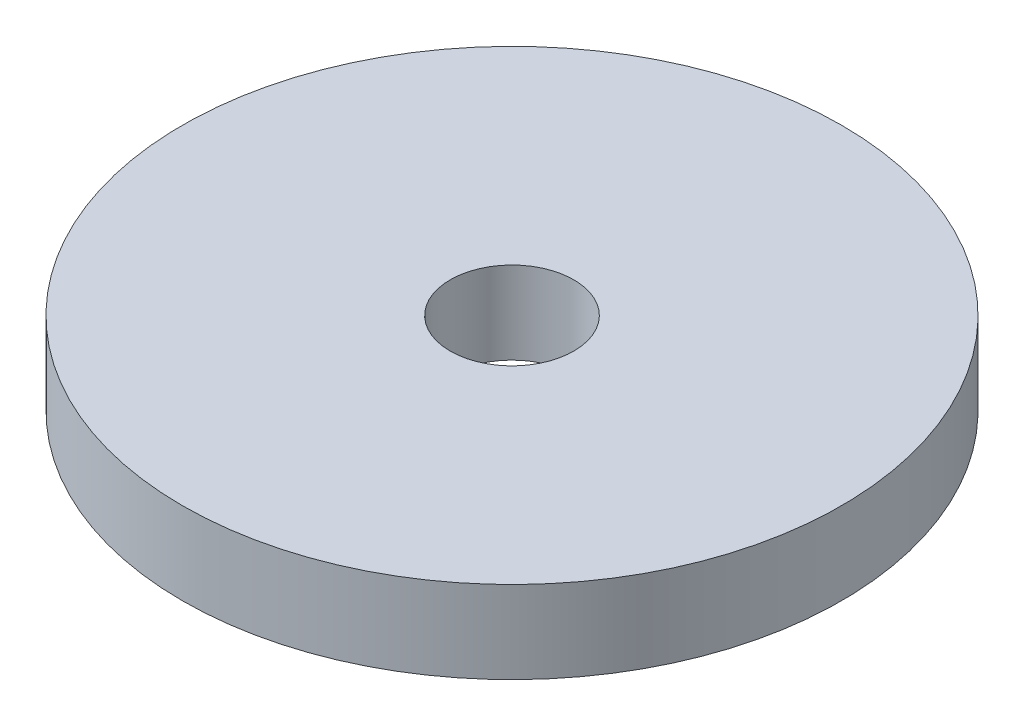
ISO-10303-21;
HEADER;
FILE_DESCRIPTION(('STEP AP214'),'2;1');
FILE_NAME('part.step','',(''),(''),'','','');
FILE_SCHEMA(('AUTOMOTIVE_DESIGN { 1 0 10303 214 1 1 1 1 }'));
ENDSEC;
DATA;
#1=APPLICATION_CONTEXT('core data for automotive mechanical design processes');
#2=APPLICATION_PROTOCOL_DEFINITION('international standard','automotive_design',2000,#1);
#3=PRODUCT_CONTEXT('',#1,'mechanical');
#4=PRODUCT('Part','Part','',(#3));
#5=PRODUCT_RELATED_PRODUCT_CATEGORY('part','',(#4));
#6=PRODUCT_DEFINITION_FORMATION('','',#4);
#7=PRODUCT_DEFINITION_CONTEXT('part definition',#1,'design');
#8=PRODUCT_DEFINITION('design','',#6,#7);
#9=PRODUCT_DEFINITION_SHAPE('','',#8);
#10=(LENGTH_UNIT() NAMED_UNIT(*) SI_UNIT(.MILLI.,.METRE.));
#11=(NAMED_UNIT(*) PLANE_ANGLE_UNIT() SI_UNIT($,.RADIAN.));
#12=(NAMED_UNIT(*) SI_UNIT($,.STERADIAN.) SOLID_ANGLE_UNIT());
#13=UNCERTAINTY_MEASURE_WITH_UNIT(LENGTH_MEASURE(1.E-05),#10,'distance_accuracy_value','');
#14=(GEOMETRIC_REPRESENTATION_CONTEXT(3) GLOBAL_UNCERTAINTY_ASSIGNED_CONTEXT((#13)) GLOBAL_UNIT_ASSIGNED_CONTEXT((#10,
#11,#12)) REPRESENTATION_CONTEXT('',''));
#15=CARTESIAN_POINT('',(0.,0.,0.));
#16=DIRECTION('',(0.,0.,1.));
#17=DIRECTION('',(1.,0.,0.));
#18=AXIS2_PLACEMENT_3D('',#15,#16,#17);
#19=CARTESIAN_POINT('',(0.,6.35,0.));
#20=DIRECTION('',(0.,1.,0.));
#21=DIRECTION('',(0.,0.,1.));
#22=AXIS2_PLACEMENT_3D('',#19,#20,#21);
#23=PLANE('',#22);
#24=CARTESIAN_POINT('',(0.,6.35,0.));
#25=DIRECTION('',(0.,1.,0.));
#26=DIRECTION('',(0.,0.,1.));
#27=AXIS2_PLACEMENT_3D('',#24,#25,#26);
#28=CIRCLE('',#27,25.4);
#29=CARTESIAN_POINT('',(0.,6.35,25.4));
#30=VERTEX_POINT('',#29);
#31=EDGE_CURVE('E10',#30,#30,#28,.T.);
#32=ORIENTED_EDGE('',*,*,#31,.T.);
#33=EDGE_LOOP('',(#32));
#34=FACE_BOUND('',#33,.T.);
#35=CARTESIAN_POINT('',(0.,6.35,0.));
#36=DIRECTION('',(0.,1.,0.));
#37=DIRECTION('',(0.,0.,1.));
#38=AXIS2_PLACEMENT_3D('',#35,#36,#37);
#39=CIRCLE('',#38,4.7625);
#40=CARTESIAN_POINT('',(0.,6.35,4.7625));
#41=VERTEX_POINT('',#40);
#42=EDGE_CURVE('E43',#41,#41,#39,.T.);
#43=ORIENTED_EDGE('',*,*,#42,.F.);
#44=EDGE_LOOP('',(#43));
#45=FACE_BOUND('',#44,.T.);
#46=ADVANCED_FACE('F32',(#34,#45),#23,.T.);
#47=CARTESIAN_POINT('',(0.,0.,0.));
#48=DIRECTION('',(0.,1.,0.));
#49=DIRECTION('',(0.,0.,1.));
#50=AXIS2_PLACEMENT_3D('',#47,#48,#49);
#51=PLANE('',#50);
#52=CARTESIAN_POINT('',(0.,0.,0.));
#53=DIRECTION('',(0.,1.,0.));
#54=DIRECTION('',(0.,0.,1.));
#55=AXIS2_PLACEMENT_3D('',#52,#53,#54);
#56=CIRCLE('',#55,25.4);
#57=CARTESIAN_POINT('',(0.,0.,25.4));
#58=VERTEX_POINT('',#57);
#59=EDGE_CURVE('E36',#58,#58,#56,.T.);
#60=ORIENTED_EDGE('',*,*,#59,.F.);
#61=EDGE_LOOP('',(#60));
#62=FACE_BOUND('',#61,.T.);
#63=CARTESIAN_POINT('',(0.,0.,0.));
#64=DIRECTION('',(0.,1.,0.));
#65=DIRECTION('',(0.,0.,1.));
#66=AXIS2_PLACEMENT_3D('',#63,#64,#65);
#67=CIRCLE('',#66,4.7625);
#68=CARTESIAN_POINT('',(0.,0.,4.7625));
#69=VERTEX_POINT('',#68);
#70=EDGE_CURVE('E45',#69,#69,#67,.T.);
#71=ORIENTED_EDGE('',*,*,#70,.T.);
#72=EDGE_LOOP('',(#71));
#73=FACE_BOUND('',#72,.T.);
#74=ADVANCED_FACE('F55',(#62,#73),#51,.F.);
#75=CARTESIAN_POINT('',(0.,6.35,0.));
#76=DIRECTION('',(0.,-1.,0.));
#77=DIRECTION('',(0.,0.,-1.));
#78=AXIS2_PLACEMENT_3D('',#75,#76,#77);
#79=CYLINDRICAL_SURFACE('',#78,25.4);
#80=ORIENTED_EDGE('',*,*,#31,.F.);
#81=EDGE_LOOP('',(#80));
#82=FACE_BOUND('',#81,.T.);
#83=ORIENTED_EDGE('',*,*,#59,.T.);
#84=EDGE_LOOP('',(#83));
#85=FACE_BOUND('',#84,.T.);
#86=ADVANCED_FACE('F34',(#82,#85),#79,.T.);
#87=CARTESIAN_POINT('',(0.,6.35,0.));
#88=DIRECTION('',(0.,-1.,0.));
#89=DIRECTION('',(0.,0.,-1.));
#90=AXIS2_PLACEMENT_3D('',#87,#88,#89);
#91=CYLINDRICAL_SURFACE('',#90,4.7625);
#92=ORIENTED_EDGE('',*,*,#42,.T.);
#93=EDGE_LOOP('',(#92));
#94=FACE_BOUND('',#93,.T.);
#95=ORIENTED_EDGE('',*,*,#70,.F.);
#96=EDGE_LOOP('',(#95));
#97=FACE_BOUND('',#96,.T.);
#98=ADVANCED_FACE('F51',(#94,#97),#91,.F.);
#99=CLOSED_SHELL('',(#46,#74,#86,#98));
#100=MANIFOLD_SOLID_BREP('B2',#99);
#101=ADVANCED_BREP_SHAPE_REPRESENTATION('',(#18,#100),#14);
#102=SHAPE_DEFINITION_REPRESENTATION(#9,#101);
ENDSEC;
END-ISO-10303-21;
